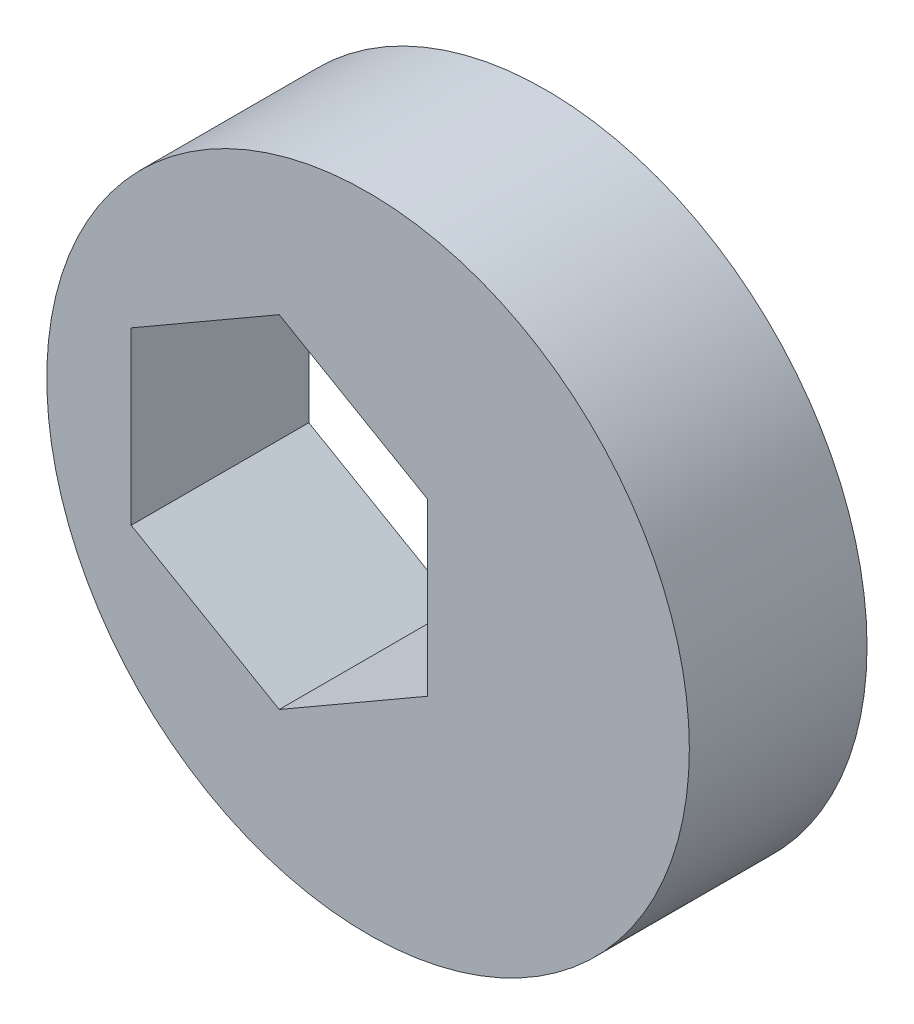
ISO-10303-21;
HEADER;
FILE_DESCRIPTION(('STEP AP214'),'2;1');
FILE_NAME('part.step','',(''),(''),'','','');
FILE_SCHEMA(('AUTOMOTIVE_DESIGN { 1 0 10303 214 1 1 1 1 }'));
ENDSEC;
DATA;
#1=APPLICATION_CONTEXT('core data for automotive mechanical design processes');
#2=APPLICATION_PROTOCOL_DEFINITION('international standard','automotive_design',2000,#1);
#3=PRODUCT_CONTEXT('',#1,'mechanical');
#4=PRODUCT('Part','Part','',(#3));
#5=PRODUCT_RELATED_PRODUCT_CATEGORY('part','',(#4));
#6=PRODUCT_DEFINITION_FORMATION('','',#4);
#7=PRODUCT_DEFINITION_CONTEXT('part definition',#1,'design');
#8=PRODUCT_DEFINITION('design','',#6,#7);
#9=PRODUCT_DEFINITION_SHAPE('','',#8);
#10=(LENGTH_UNIT() NAMED_UNIT(*) SI_UNIT(.MILLI.,.METRE.));
#11=(NAMED_UNIT(*) PLANE_ANGLE_UNIT() SI_UNIT($,.RADIAN.));
#12=(NAMED_UNIT(*) SI_UNIT($,.STERADIAN.) SOLID_ANGLE_UNIT());
#13=UNCERTAINTY_MEASURE_WITH_UNIT(LENGTH_MEASURE(1.E-05),#10,'distance_accuracy_value','');
#14=(GEOMETRIC_REPRESENTATION_CONTEXT(3) GLOBAL_UNCERTAINTY_ASSIGNED_CONTEXT((#13)) GLOBAL_UNIT_ASSIGNED_CONTEXT((#10,
#11,#12)) REPRESENTATION_CONTEXT('',''));
#15=CARTESIAN_POINT('',(0.,0.,0.));
#16=DIRECTION('',(0.,0.,1.));
#17=DIRECTION('',(1.,0.,0.));
#18=AXIS2_PLACEMENT_3D('',#15,#16,#17);
#19=CARTESIAN_POINT('',(3.,0.,-6.));
#20=DIRECTION('',(0.,0.,1.));
#21=DIRECTION('',(1.,0.,0.));
#22=AXIS2_PLACEMENT_3D('',#19,#20,#21);
#23=CYLINDRICAL_SURFACE('',#22,10.85);
#24=CARTESIAN_POINT('',(3.,0.,-6.));
#25=DIRECTION('',(0.,0.,1.));
#26=DIRECTION('',(1.,0.,0.));
#27=AXIS2_PLACEMENT_3D('',#24,#25,#26);
#28=CIRCLE('',#27,10.85);
#29=CARTESIAN_POINT('',(13.85,0.,-6.));
#30=VERTEX_POINT('',#29);
#31=EDGE_CURVE('E11',#30,#30,#28,.T.);
#32=ORIENTED_EDGE('',*,*,#31,.T.);
#33=EDGE_LOOP('',(#32));
#34=FACE_BOUND('',#33,.T.);
#35=CARTESIAN_POINT('',(3.,0.,0.));
#36=DIRECTION('',(0.,0.,1.));
#37=DIRECTION('',(1.,0.,0.));
#38=AXIS2_PLACEMENT_3D('',#35,#36,#37);
#39=CIRCLE('',#38,10.85);
#40=CARTESIAN_POINT('',(13.85,0.,0.));
#41=VERTEX_POINT('',#40);
#42=EDGE_CURVE('E39',#41,#41,#39,.T.);
#43=ORIENTED_EDGE('',*,*,#42,.F.);
#44=EDGE_LOOP('',(#43));
#45=FACE_BOUND('',#44,.T.);
#46=ADVANCED_FACE('F36',(#34,#45),#23,.T.);
#47=CARTESIAN_POINT('',(3.,0.,-6.));
#48=DIRECTION('',(0.,0.,1.));
#49=DIRECTION('',(1.,0.,0.));
#50=AXIS2_PLACEMENT_3D('',#47,#48,#49);
#51=PLANE('',#50);
#52=DIRECTION('',(0.,1.,0.));
#53=VECTOR('',#52,1.);
#54=CARTESIAN_POINT('',(5.00000000000002,-2.88675134594814,-6.));
#55=LINE('',#54,#53);
#56=CARTESIAN_POINT('',(5.00000000000002,-2.88675134594814,-6.));
#57=VERTEX_POINT('',#56);
#58=CARTESIAN_POINT('',(5.00000000000002,2.88675134594814,-6.));
#59=VERTEX_POINT('',#58);
#60=EDGE_CURVE('E96',#57,#59,#55,.T.);
#61=ORIENTED_EDGE('',*,*,#60,.T.);
#62=DIRECTION('',(-0.866025403784439,0.5,0.));
#63=VECTOR('',#62,1.);
#64=CARTESIAN_POINT('',(5.00000000000002,2.88675134594814,-6.));
#65=LINE('',#64,#63);
#66=CARTESIAN_POINT('',(0.,5.77350269189628,-6.));
#67=VERTEX_POINT('',#66);
#68=EDGE_CURVE('E90',#59,#67,#65,.T.);
#69=ORIENTED_EDGE('',*,*,#68,.T.);
#70=DIRECTION('',(-0.866025403784439,-0.5,0.));
#71=VECTOR('',#70,1.);
#72=CARTESIAN_POINT('',(0.,5.77350269189628,-6.));
#73=LINE('',#72,#71);
#74=CARTESIAN_POINT('',(-5.00000000000002,2.88675134594814,-6.));
#75=VERTEX_POINT('',#74);
#76=EDGE_CURVE('E99',#67,#75,#73,.T.);
#77=ORIENTED_EDGE('',*,*,#76,.T.);
#78=DIRECTION('',(0.,-1.,0.));
#79=VECTOR('',#78,1.);
#80=CARTESIAN_POINT('',(-5.00000000000002,2.88675134594814,-6.));
#81=LINE('',#80,#79);
#82=CARTESIAN_POINT('',(-5.00000000000002,-2.88675134594814,-6.));
#83=VERTEX_POINT('',#82);
#84=EDGE_CURVE('E50',#75,#83,#81,.T.);
#85=ORIENTED_EDGE('',*,*,#84,.T.);
#86=DIRECTION('',(0.866025403784438,-0.5,0.));
#87=VECTOR('',#86,1.);
#88=CARTESIAN_POINT('',(-5.00000000000002,-2.88675134594814,-6.));
#89=LINE('',#88,#87);
#90=CARTESIAN_POINT('',(0.,-5.77350269189628,-6.));
#91=VERTEX_POINT('',#90);
#92=EDGE_CURVE('E114',#83,#91,#89,.T.);
#93=ORIENTED_EDGE('',*,*,#92,.T.);
#94=DIRECTION('',(0.866025403784439,0.5,0.));
#95=VECTOR('',#94,1.);
#96=CARTESIAN_POINT('',(0.,-5.77350269189628,-6.));
#97=LINE('',#96,#95);
#98=EDGE_CURVE('E117',#91,#57,#97,.T.);
#99=ORIENTED_EDGE('',*,*,#98,.T.);
#100=EDGE_LOOP('',(#61,#69,#77,#85,#93,#99));
#101=FACE_BOUND('',#100,.T.);
#102=ORIENTED_EDGE('',*,*,#31,.F.);
#103=EDGE_LOOP('',(#102));
#104=FACE_BOUND('',#103,.T.);
#105=ADVANCED_FACE('F103',(#101,#104),#51,.F.);
#106=CARTESIAN_POINT('',(3.,0.,0.));
#107=DIRECTION('',(0.,0.,1.));
#108=DIRECTION('',(1.,0.,0.));
#109=AXIS2_PLACEMENT_3D('',#106,#107,#108);
#110=PLANE('',#109);
#111=DIRECTION('',(-0.866025403784439,0.5,0.));
#112=VECTOR('',#111,1.);
#113=CARTESIAN_POINT('',(5.00000000000002,2.88675134594814,0.));
#114=LINE('',#113,#112);
#115=CARTESIAN_POINT('',(5.00000000000002,2.88675134594814,0.));
#116=VERTEX_POINT('',#115);
#117=CARTESIAN_POINT('',(0.,5.77350269189628,0.));
#118=VERTEX_POINT('',#117);
#119=EDGE_CURVE('E58',#116,#118,#114,.T.);
#120=ORIENTED_EDGE('',*,*,#119,.F.);
#121=DIRECTION('',(0.,1.,0.));
#122=VECTOR('',#121,1.);
#123=CARTESIAN_POINT('',(5.00000000000002,-2.88675134594814,0.));
#124=LINE('',#123,#122);
#125=CARTESIAN_POINT('',(5.00000000000002,-2.88675134594814,0.));
#126=VERTEX_POINT('',#125);
#127=EDGE_CURVE('E107',#126,#116,#124,.T.);
#128=ORIENTED_EDGE('',*,*,#127,.F.);
#129=DIRECTION('',(0.866025403784439,0.5,0.));
#130=VECTOR('',#129,1.);
#131=CARTESIAN_POINT('',(0.,-5.77350269189628,0.));
#132=LINE('',#131,#130);
#133=CARTESIAN_POINT('',(0.,-5.77350269189628,0.));
#134=VERTEX_POINT('',#133);
#135=EDGE_CURVE('E110',#134,#126,#132,.T.);
#136=ORIENTED_EDGE('',*,*,#135,.F.);
#137=DIRECTION('',(0.866025403784438,-0.5,0.));
#138=VECTOR('',#137,1.);
#139=CARTESIAN_POINT('',(-5.00000000000002,-2.88675134594814,0.));
#140=LINE('',#139,#138);
#141=CARTESIAN_POINT('',(-5.00000000000002,-2.88675134594814,0.));
#142=VERTEX_POINT('',#141);
#143=EDGE_CURVE('E126',#142,#134,#140,.T.);
#144=ORIENTED_EDGE('',*,*,#143,.F.);
#145=DIRECTION('',(0.,-1.,0.));
#146=VECTOR('',#145,1.);
#147=CARTESIAN_POINT('',(-5.00000000000002,2.88675134594814,0.));
#148=LINE('',#147,#146);
#149=CARTESIAN_POINT('',(-5.00000000000002,2.88675134594814,0.));
#150=VERTEX_POINT('',#149);
#151=EDGE_CURVE('E123',#150,#142,#148,.T.);
#152=ORIENTED_EDGE('',*,*,#151,.F.);
#153=DIRECTION('',(-0.866025403784439,-0.5,0.));
#154=VECTOR('',#153,1.);
#155=CARTESIAN_POINT('',(0.,5.77350269189628,0.));
#156=LINE('',#155,#154);
#157=EDGE_CURVE('E121',#118,#150,#156,.T.);
#158=ORIENTED_EDGE('',*,*,#157,.F.);
#159=EDGE_LOOP('',(#120,#128,#136,#144,#152,#158));
#160=FACE_BOUND('',#159,.T.);
#161=ORIENTED_EDGE('',*,*,#42,.T.);
#162=EDGE_LOOP('',(#161));
#163=FACE_BOUND('',#162,.T.);
#164=ADVANCED_FACE('F143',(#160,#163),#110,.T.);
#165=CARTESIAN_POINT('',(5.00000000000002,2.88675134594814,-6.));
#166=DIRECTION('',(0.5,0.866025403784439,0.));
#167=DIRECTION('',(-0.866025403784439,0.5,0.));
#168=AXIS2_PLACEMENT_3D('',#165,#166,#167);
#169=PLANE('',#168);
#170=ORIENTED_EDGE('',*,*,#119,.T.);
#171=DIRECTION('',(0.,0.,1.));
#172=VECTOR('',#171,1.);
#173=CARTESIAN_POINT('',(0.,5.77350269189628,-6.));
#174=LINE('',#173,#172);
#175=EDGE_CURVE('E86',#67,#118,#174,.T.);
#176=ORIENTED_EDGE('',*,*,#175,.F.);
#177=ORIENTED_EDGE('',*,*,#68,.F.);
#178=DIRECTION('',(0.,0.,1.));
#179=VECTOR('',#178,1.);
#180=CARTESIAN_POINT('',(5.00000000000002,2.88675134594814,-6.));
#181=LINE('',#180,#179);
#182=EDGE_CURVE('E131',#59,#116,#181,.T.);
#183=ORIENTED_EDGE('',*,*,#182,.T.);
#184=EDGE_LOOP('',(#170,#176,#177,#183));
#185=FACE_BOUND('',#184,.T.);
#186=ADVANCED_FACE('F88',(#185),#169,.F.);
#187=CARTESIAN_POINT('',(5.00000000000002,-2.88675134594814,-6.));
#188=DIRECTION('',(1.,0.,0.));
#189=DIRECTION('',(0.,0.,-1.));
#190=AXIS2_PLACEMENT_3D('',#187,#188,#189);
#191=PLANE('',#190);
#192=ORIENTED_EDGE('',*,*,#127,.T.);
#193=ORIENTED_EDGE('',*,*,#182,.F.);
#194=ORIENTED_EDGE('',*,*,#60,.F.);
#195=DIRECTION('',(0.,0.,1.));
#196=VECTOR('',#195,1.);
#197=CARTESIAN_POINT('',(5.00000000000002,-2.88675134594814,-6.));
#198=LINE('',#197,#196);
#199=EDGE_CURVE('E133',#57,#126,#198,.T.);
#200=ORIENTED_EDGE('',*,*,#199,.T.);
#201=EDGE_LOOP('',(#192,#193,#194,#200));
#202=FACE_BOUND('',#201,.T.);
#203=ADVANCED_FACE('F154',(#202),#191,.F.);
#204=CARTESIAN_POINT('',(0.,-5.77350269189628,-6.));
#205=DIRECTION('',(0.5,-0.866025403784439,0.));
#206=DIRECTION('',(0.866025403784439,0.5,0.));
#207=AXIS2_PLACEMENT_3D('',#204,#205,#206);
#208=PLANE('',#207);
#209=ORIENTED_EDGE('',*,*,#135,.T.);
#210=ORIENTED_EDGE('',*,*,#199,.F.);
#211=ORIENTED_EDGE('',*,*,#98,.F.);
#212=DIRECTION('',(0.,0.,1.));
#213=VECTOR('',#212,1.);
#214=CARTESIAN_POINT('',(0.,-5.77350269189628,-6.));
#215=LINE('',#214,#213);
#216=EDGE_CURVE('E135',#91,#134,#215,.T.);
#217=ORIENTED_EDGE('',*,*,#216,.T.);
#218=EDGE_LOOP('',(#209,#210,#211,#217));
#219=FACE_BOUND('',#218,.T.);
#220=ADVANCED_FACE('F152',(#219),#208,.F.);
#221=CARTESIAN_POINT('',(-5.00000000000002,-2.88675134594814,-6.));
#222=DIRECTION('',(-0.5,-0.866025403784439,0.));
#223=DIRECTION('',(0.866025403784439,-0.5,0.));
#224=AXIS2_PLACEMENT_3D('',#221,#222,#223);
#225=PLANE('',#224);
#226=ORIENTED_EDGE('',*,*,#143,.T.);
#227=ORIENTED_EDGE('',*,*,#216,.F.);
#228=ORIENTED_EDGE('',*,*,#92,.F.);
#229=DIRECTION('',(0.,0.,1.));
#230=VECTOR('',#229,1.);
#231=CARTESIAN_POINT('',(-5.00000000000002,-2.88675134594814,-6.));
#232=LINE('',#231,#230);
#233=EDGE_CURVE('E137',#83,#142,#232,.T.);
#234=ORIENTED_EDGE('',*,*,#233,.T.);
#235=EDGE_LOOP('',(#226,#227,#228,#234));
#236=FACE_BOUND('',#235,.T.);
#237=ADVANCED_FACE('F148',(#236),#225,.F.);
#238=CARTESIAN_POINT('',(-5.00000000000002,2.88675134594814,-6.));
#239=DIRECTION('',(-1.,0.,0.));
#240=DIRECTION('',(0.,-1.,0.));
#241=AXIS2_PLACEMENT_3D('',#238,#239,#240);
#242=PLANE('',#241);
#243=ORIENTED_EDGE('',*,*,#151,.T.);
#244=ORIENTED_EDGE('',*,*,#233,.F.);
#245=ORIENTED_EDGE('',*,*,#84,.F.);
#246=DIRECTION('',(0.,0.,1.));
#247=VECTOR('',#246,1.);
#248=CARTESIAN_POINT('',(-5.00000000000002,2.88675134594814,-6.));
#249=LINE('',#248,#247);
#250=EDGE_CURVE('E95',#75,#150,#249,.T.);
#251=ORIENTED_EDGE('',*,*,#250,.T.);
#252=EDGE_LOOP('',(#243,#244,#245,#251));
#253=FACE_BOUND('',#252,.T.);
#254=ADVANCED_FACE('F139',(#253),#242,.F.);
#255=CARTESIAN_POINT('',(0.,5.77350269189628,-6.));
#256=DIRECTION('',(-0.5,0.866025403784439,0.));
#257=DIRECTION('',(-0.866025403784439,-0.5,0.));
#258=AXIS2_PLACEMENT_3D('',#255,#256,#257);
#259=PLANE('',#258);
#260=ORIENTED_EDGE('',*,*,#157,.T.);
#261=ORIENTED_EDGE('',*,*,#250,.F.);
#262=ORIENTED_EDGE('',*,*,#76,.F.);
#263=ORIENTED_EDGE('',*,*,#175,.T.);
#264=EDGE_LOOP('',(#260,#261,#262,#263));
#265=FACE_BOUND('',#264,.T.);
#266=ADVANCED_FACE('F100',(#265),#259,.F.);
#267=CLOSED_SHELL('',(#46,#105,#164,#186,#203,#220,#237,#254,#266));
#268=MANIFOLD_SOLID_BREP('B2',#267);
#269=ADVANCED_BREP_SHAPE_REPRESENTATION('',(#18,#268),#14);
#270=SHAPE_DEFINITION_REPRESENTATION(#9,#269);
ENDSEC;
END-ISO-10303-21;
